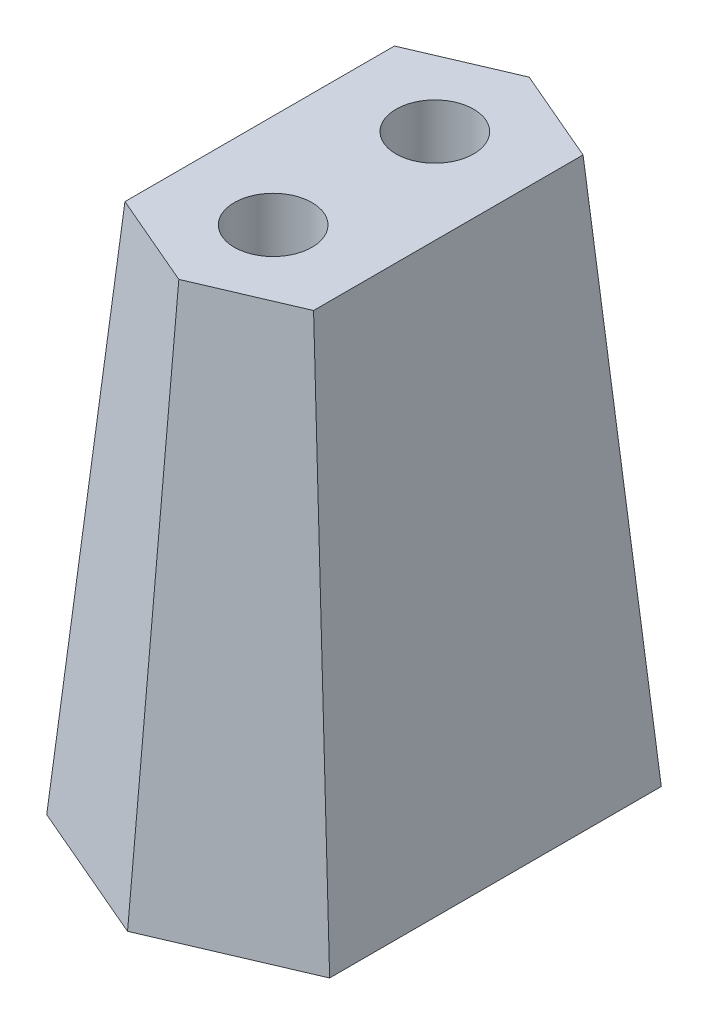
ISO-10303-21;
HEADER;
FILE_DESCRIPTION(('STEP AP214'),'2;1');
FILE_NAME('part.step','',(''),(''),'','','');
FILE_SCHEMA(('AUTOMOTIVE_DESIGN { 1 0 10303 214 1 1 1 1 }'));
ENDSEC;
DATA;
#1=APPLICATION_CONTEXT('core data for automotive mechanical design processes');
#2=APPLICATION_PROTOCOL_DEFINITION('international standard','automotive_design',2000,#1);
#3=PRODUCT_CONTEXT('',#1,'mechanical');
#4=PRODUCT('Part','Part','',(#3));
#5=PRODUCT_RELATED_PRODUCT_CATEGORY('part','',(#4));
#6=PRODUCT_DEFINITION_FORMATION('','',#4);
#7=PRODUCT_DEFINITION_CONTEXT('part definition',#1,'design');
#8=PRODUCT_DEFINITION('design','',#6,#7);
#9=PRODUCT_DEFINITION_SHAPE('','',#8);
#10=(LENGTH_UNIT() NAMED_UNIT(*) SI_UNIT(.MILLI.,.METRE.));
#11=(NAMED_UNIT(*) PLANE_ANGLE_UNIT() SI_UNIT($,.RADIAN.));
#12=(NAMED_UNIT(*) SI_UNIT($,.STERADIAN.) SOLID_ANGLE_UNIT());
#13=UNCERTAINTY_MEASURE_WITH_UNIT(LENGTH_MEASURE(1.E-05),#10,'distance_accuracy_value','');
#14=(GEOMETRIC_REPRESENTATION_CONTEXT(3) GLOBAL_UNCERTAINTY_ASSIGNED_CONTEXT((#13)) GLOBAL_UNIT_ASSIGNED_CONTEXT((#10,
#11,#12)) REPRESENTATION_CONTEXT('',''));
#15=CARTESIAN_POINT('',(0.,0.,0.));
#16=DIRECTION('',(0.,0.,1.));
#17=DIRECTION('',(1.,0.,0.));
#18=AXIS2_PLACEMENT_3D('',#15,#16,#17);
#19=CARTESIAN_POINT('',(0.,0.,0.));
#20=DIRECTION('',(0.,1.,0.));
#21=DIRECTION('',(0.,0.,1.));
#22=AXIS2_PLACEMENT_3D('',#19,#20,#21);
#23=PLANE('',#22);
#24=DIRECTION('',(0.919145030018058,0.,0.393919298579168));
#25=VECTOR('',#24,1.);
#26=CARTESIAN_POINT('',(0.689269459395217,0.,-8.10829540525551));
#27=LINE('',#26,#25);
#28=CARTESIAN_POINT('',(5.24977327051848,0.,-6.15379377191696));
#29=VERTEX_POINT('',#28);
#30=CARTESIAN_POINT('',(0.,0.,-8.40369660213917));
#31=VERTEX_POINT('',#30);
#32=EDGE_CURVE('E206',#29,#31,#27,.F.);
#33=ORIENTED_EDGE('',*,*,#32,.F.);
#34=DIRECTION('',(0.,0.,1.));
#35=VECTOR('',#34,1.);
#36=CARTESIAN_POINT('',(5.24977327051848,0.,5.));
#37=LINE('',#36,#35);
#38=CARTESIAN_POINT('',(5.24977327051848,0.,6.15379377191697));
#39=VERTEX_POINT('',#38);
#40=EDGE_CURVE('E202',#39,#29,#37,.F.);
#41=ORIENTED_EDGE('',*,*,#40,.F.);
#42=DIRECTION('',(-0.919145030018058,0.,0.393919298579168));
#43=VECTOR('',#42,1.);
#44=CARTESIAN_POINT('',(4.18926945939522,0.,6.60829540525551));
#45=LINE('',#44,#43);
#46=CARTESIAN_POINT('',(0.,0.,8.40369660213917));
#47=VERTEX_POINT('',#46);
#48=EDGE_CURVE('E198',#47,#39,#45,.F.);
#49=ORIENTED_EDGE('',*,*,#48,.F.);
#50=DIRECTION('',(-0.919145030018058,0.,-0.393919298579168));
#51=VECTOR('',#50,1.);
#52=CARTESIAN_POINT('',(-0.689269459395218,0.,8.10829540525551));
#53=LINE('',#52,#51);
#54=CARTESIAN_POINT('',(-5.24977327051848,0.,6.15379377191696));
#55=VERTEX_POINT('',#54);
#56=EDGE_CURVE('E195',#55,#47,#53,.F.);
#57=ORIENTED_EDGE('',*,*,#56,.F.);
#58=DIRECTION('',(0.,0.,-1.));
#59=VECTOR('',#58,1.);
#60=CARTESIAN_POINT('',(-5.24977327051848,0.,5.));
#61=LINE('',#60,#59);
#62=CARTESIAN_POINT('',(-5.24977327051849,0.,-6.15379377191696));
#63=VERTEX_POINT('',#62);
#64=EDGE_CURVE('E199',#63,#55,#61,.F.);
#65=ORIENTED_EDGE('',*,*,#64,.F.);
#66=DIRECTION('',(0.919145030018058,0.,-0.393919298579168));
#67=VECTOR('',#66,1.);
#68=CARTESIAN_POINT('',(-4.18926945939522,0.,-6.6082954052555));
#69=LINE('',#68,#67);
#70=EDGE_CURVE('E210',#31,#63,#69,.F.);
#71=ORIENTED_EDGE('',*,*,#70,.F.);
#72=EDGE_LOOP('',(#33,#41,#49,#57,#65,#71));
#73=FACE_BOUND('',#72,.T.);
#74=DIRECTION('',(-0.919145030018058,0.,-0.393919298579168));
#75=VECTOR('',#74,1.);
#76=CARTESIAN_POINT('',(0.347293002806306,0.,-7.31035033988138));
#77=LINE('',#76,#75);
#78=CARTESIAN_POINT('',(4.38163490354232,0.,-5.58134666813737));
#79=VERTEX_POINT('',#78);
#80=CARTESIAN_POINT('',(0.,0.,-7.45919019822694));
#81=VERTEX_POINT('',#80);
#82=EDGE_CURVE('E59',#79,#81,#77,.T.);
#83=ORIENTED_EDGE('',*,*,#82,.T.);
#84=DIRECTION('',(-0.919145030018058,0.,0.393919298579168));
#85=VECTOR('',#84,1.);
#86=CARTESIAN_POINT('',(-3.84729300280631,0.,-5.81035033988138));
#87=LINE('',#86,#85);
#88=CARTESIAN_POINT('',(-4.38163490354233,0.,-5.58134666813737));
#89=VERTEX_POINT('',#88);
#90=EDGE_CURVE('E43',#81,#89,#87,.T.);
#91=ORIENTED_EDGE('',*,*,#90,.T.);
#92=DIRECTION('',(0.,0.,1.));
#93=VECTOR('',#92,1.);
#94=CARTESIAN_POINT('',(-4.38163490354233,0.,5.));
#95=LINE('',#94,#93);
#96=CARTESIAN_POINT('',(-4.38163490354233,0.,5.58134666813737));
#97=VERTEX_POINT('',#96);
#98=EDGE_CURVE('E171',#89,#97,#95,.T.);
#99=ORIENTED_EDGE('',*,*,#98,.T.);
#100=DIRECTION('',(0.919145030018058,0.,0.393919298579168));
#101=VECTOR('',#100,1.);
#102=CARTESIAN_POINT('',(-0.347293002806306,0.,7.31035033988138));
#103=LINE('',#102,#101);
#104=CARTESIAN_POINT('',(0.,0.,7.45919019822694));
#105=VERTEX_POINT('',#104);
#106=EDGE_CURVE('E167',#97,#105,#103,.T.);
#107=ORIENTED_EDGE('',*,*,#106,.T.);
#108=DIRECTION('',(0.919145030018058,0.,-0.393919298579168));
#109=VECTOR('',#108,1.);
#110=CARTESIAN_POINT('',(3.84729300280631,0.,5.81035033988138));
#111=LINE('',#110,#109);
#112=CARTESIAN_POINT('',(4.38163490354233,0.,5.58134666813737));
#113=VERTEX_POINT('',#112);
#114=EDGE_CURVE('E149',#105,#113,#111,.T.);
#115=ORIENTED_EDGE('',*,*,#114,.T.);
#116=DIRECTION('',(0.,0.,-1.));
#117=VECTOR('',#116,1.);
#118=CARTESIAN_POINT('',(4.38163490354233,0.,5.));
#119=LINE('',#118,#117);
#120=EDGE_CURVE('E160',#113,#79,#119,.T.);
#121=ORIENTED_EDGE('',*,*,#120,.T.);
#122=EDGE_LOOP('',(#83,#91,#99,#107,#115,#121));
#123=FACE_BOUND('',#122,.T.);
#124=ADVANCED_FACE('F39',(#73,#123),#23,.F.);
#125=CARTESIAN_POINT('',(0.,20.,-6.5));
#126=DIRECTION('',(0.392420316720586,0.0871557427476584,-0.915647405681368));
#127=DIRECTION('',(-0.919145030018058,0.,-0.393919298579168));
#128=AXIS2_PLACEMENT_3D('',#125,#126,#127);
#129=PLANE('',#128);
#130=ORIENTED_EDGE('',*,*,#32,.T.);
#131=DIRECTION('',(0.,-0.995500475857492,-0.0947565436658919));
#132=VECTOR('',#131,1.);
#133=CARTESIAN_POINT('',(0.,20.141495276465,-6.48653179614874));
#134=LINE('',#133,#132);
#135=CARTESIAN_POINT('',(0.,20.,-6.5));
#136=VERTEX_POINT('',#135);
#137=EDGE_CURVE('E11',#136,#31,#134,.T.);
#138=ORIENTED_EDGE('',*,*,#137,.F.);
#139=DIRECTION('',(-0.919145030018058,0.,-0.393919298579168));
#140=VECTOR('',#139,1.);
#141=CARTESIAN_POINT('',(0.,20.,-6.5));
#142=LINE('',#141,#140);
#143=CARTESIAN_POINT('',(3.5,20.,-5.));
#144=VERTEX_POINT('',#143);
#145=EDGE_CURVE('E205',#144,#136,#142,.T.);
#146=ORIENTED_EDGE('',*,*,#145,.F.);
#147=DIRECTION('',(0.087012168456116,-0.994553636430084,-0.05737548957752));
#148=VECTOR('',#147,1.);
#149=CARTESIAN_POINT('',(3.48098963753853,20.217289437229,-4.98746464003109));
#150=LINE('',#149,#148);
#151=EDGE_CURVE('E225',#144,#29,#150,.T.);
#152=ORIENTED_EDGE('',*,*,#151,.T.);
#153=EDGE_LOOP('',(#130,#138,#146,#152));
#154=FACE_BOUND('',#153,.T.);
#155=ADVANCED_FACE('F292',(#154),#129,.T.);
#156=CARTESIAN_POINT('',(-3.5,20.,-5.));
#157=DIRECTION('',(-0.392420316720587,0.0871557427476584,-0.915647405681367));
#158=DIRECTION('',(-0.919145030018058,0.,0.393919298579168));
#159=AXIS2_PLACEMENT_3D('',#156,#157,#158);
#160=PLANE('',#159);
#161=ORIENTED_EDGE('',*,*,#70,.T.);
#162=DIRECTION('',(-0.087012168456116,-0.994553636430084,-0.05737548957752));
#163=VECTOR('',#162,1.);
#164=CARTESIAN_POINT('',(-3.45007634235629,20.5706300180128,-4.96708053195739));
#165=LINE('',#164,#163);
#166=CARTESIAN_POINT('',(-3.5,20.,-5.));
#167=VERTEX_POINT('',#166);
#168=EDGE_CURVE('E50',#167,#63,#165,.T.);
#169=ORIENTED_EDGE('',*,*,#168,.F.);
#170=DIRECTION('',(-0.919145030018058,0.,0.393919298579168));
#171=VECTOR('',#170,1.);
#172=CARTESIAN_POINT('',(-3.5,20.,-5.));
#173=LINE('',#172,#171);
#174=EDGE_CURVE('E247',#136,#167,#173,.T.);
#175=ORIENTED_EDGE('',*,*,#174,.F.);
#176=ORIENTED_EDGE('',*,*,#137,.T.);
#177=EDGE_LOOP('',(#161,#169,#175,#176));
#178=FACE_BOUND('',#177,.T.);
#179=ADVANCED_FACE('F298',(#178),#160,.T.);
#180=CARTESIAN_POINT('',(-3.5,20.,5.));
#181=DIRECTION('',(-0.996194698091746,0.0871557427476584,0.));
#182=DIRECTION('',(-0.0871557427476584,-0.996194698091746,0.));
#183=AXIS2_PLACEMENT_3D('',#180,#181,#182);
#184=PLANE('',#183);
#185=ORIENTED_EDGE('',*,*,#64,.T.);
#186=DIRECTION('',(-0.087012168456116,-0.994553636430084,0.05737548957752));
#187=VECTOR('',#186,1.);
#188=CARTESIAN_POINT('',(-3.48098963753853,20.217289437229,4.98746464003109));
#189=LINE('',#188,#187);
#190=CARTESIAN_POINT('',(-3.5,20.,5.));
#191=VERTEX_POINT('',#190);
#192=EDGE_CURVE('E220',#191,#55,#189,.T.);
#193=ORIENTED_EDGE('',*,*,#192,.F.);
#194=DIRECTION('',(0.,0.,1.));
#195=VECTOR('',#194,1.);
#196=CARTESIAN_POINT('',(-3.5,20.,5.));
#197=LINE('',#196,#195);
#198=EDGE_CURVE('E244',#167,#191,#197,.T.);
#199=ORIENTED_EDGE('',*,*,#198,.F.);
#200=ORIENTED_EDGE('',*,*,#168,.T.);
#201=EDGE_LOOP('',(#185,#193,#199,#200));
#202=FACE_BOUND('',#201,.T.);
#203=ADVANCED_FACE('F306',(#202),#184,.T.);
#204=CARTESIAN_POINT('',(0.,20.,6.5));
#205=DIRECTION('',(-0.392420316720587,0.0871557427476584,0.915647405681367));
#206=DIRECTION('',(0.919145030018058,0.,0.393919298579168));
#207=AXIS2_PLACEMENT_3D('',#204,#205,#206);
#208=PLANE('',#207);
#209=ORIENTED_EDGE('',*,*,#56,.T.);
#210=DIRECTION('',(0.,-0.995500475857492,0.0947565436658919));
#211=VECTOR('',#210,1.);
#212=CARTESIAN_POINT('',(0.,20.141495276465,6.48653179614874));
#213=LINE('',#212,#211);
#214=CARTESIAN_POINT('',(0.,20.,6.5));
#215=VERTEX_POINT('',#214);
#216=EDGE_CURVE('E216',#215,#47,#213,.T.);
#217=ORIENTED_EDGE('',*,*,#216,.F.);
#218=DIRECTION('',(0.919145030018058,0.,0.393919298579168));
#219=VECTOR('',#218,1.);
#220=CARTESIAN_POINT('',(0.,20.,6.5));
#221=LINE('',#220,#219);
#222=EDGE_CURVE('E241',#191,#215,#221,.T.);
#223=ORIENTED_EDGE('',*,*,#222,.F.);
#224=ORIENTED_EDGE('',*,*,#192,.T.);
#225=EDGE_LOOP('',(#209,#217,#223,#224));
#226=FACE_BOUND('',#225,.T.);
#227=ADVANCED_FACE('F309',(#226),#208,.T.);
#228=CARTESIAN_POINT('',(3.5,20.,5.));
#229=DIRECTION('',(0.392420316720586,0.0871557427476584,0.915647405681367));
#230=DIRECTION('',(0.919145030018058,0.,-0.393919298579168));
#231=AXIS2_PLACEMENT_3D('',#228,#229,#230);
#232=PLANE('',#231);
#233=ORIENTED_EDGE('',*,*,#48,.T.);
#234=DIRECTION('',(0.087012168456116,-0.994553636430084,0.05737548957752));
#235=VECTOR('',#234,1.);
#236=CARTESIAN_POINT('',(3.5,20.,5.));
#237=LINE('',#236,#235);
#238=CARTESIAN_POINT('',(3.5,20.,5.));
#239=VERTEX_POINT('',#238);
#240=EDGE_CURVE('E221',#239,#39,#237,.T.);
#241=ORIENTED_EDGE('',*,*,#240,.F.);
#242=DIRECTION('',(0.919145030018058,0.,-0.393919298579168));
#243=VECTOR('',#242,1.);
#244=CARTESIAN_POINT('',(3.5,20.,5.));
#245=LINE('',#244,#243);
#246=EDGE_CURVE('E238',#215,#239,#245,.T.);
#247=ORIENTED_EDGE('',*,*,#246,.F.);
#248=ORIENTED_EDGE('',*,*,#216,.T.);
#249=EDGE_LOOP('',(#233,#241,#247,#248));
#250=FACE_BOUND('',#249,.T.);
#251=ADVANCED_FACE('F317',(#250),#232,.T.);
#252=CARTESIAN_POINT('',(3.5,20.,5.));
#253=DIRECTION('',(0.996194698091746,0.0871557427476584,0.));
#254=DIRECTION('',(-0.0871557427476584,0.996194698091746,0.));
#255=AXIS2_PLACEMENT_3D('',#252,#253,#254);
#256=PLANE('',#255);
#257=ORIENTED_EDGE('',*,*,#40,.T.);
#258=ORIENTED_EDGE('',*,*,#151,.F.);
#259=DIRECTION('',(0.,0.,-1.));
#260=VECTOR('',#259,1.);
#261=CARTESIAN_POINT('',(3.5,20.,5.));
#262=LINE('',#261,#260);
#263=EDGE_CURVE('E228',#239,#144,#262,.T.);
#264=ORIENTED_EDGE('',*,*,#263,.F.);
#265=ORIENTED_EDGE('',*,*,#240,.T.);
#266=EDGE_LOOP('',(#257,#258,#264,#265));
#267=FACE_BOUND('',#266,.T.);
#268=ADVANCED_FACE('F314',(#267),#256,.T.);
#269=CARTESIAN_POINT('',(0.,20.,0.));
#270=DIRECTION('',(0.,1.,0.));
#271=DIRECTION('',(0.,0.,1.));
#272=AXIS2_PLACEMENT_3D('',#269,#270,#271);
#273=PLANE('',#272);
#274=CARTESIAN_POINT('',(0.,20.,-3.));
#275=DIRECTION('',(0.,1.,0.));
#276=DIRECTION('',(0.,0.,1.));
#277=AXIS2_PLACEMENT_3D('',#274,#275,#276);
#278=CIRCLE('',#277,1.44);
#279=CARTESIAN_POINT('',(0.,20.,-1.56));
#280=VERTEX_POINT('',#279);
#281=EDGE_CURVE('E211',#280,#280,#278,.T.);
#282=ORIENTED_EDGE('',*,*,#281,.F.);
#283=EDGE_LOOP('',(#282));
#284=FACE_BOUND('',#283,.T.);
#285=CARTESIAN_POINT('',(0.,20.,3.));
#286=DIRECTION('',(0.,1.,0.));
#287=DIRECTION('',(0.,0.,1.));
#288=AXIS2_PLACEMENT_3D('',#285,#286,#287);
#289=CIRCLE('',#288,1.44);
#290=CARTESIAN_POINT('',(0.,20.,4.44));
#291=VERTEX_POINT('',#290);
#292=EDGE_CURVE('E253',#291,#291,#289,.T.);
#293=ORIENTED_EDGE('',*,*,#292,.F.);
#294=EDGE_LOOP('',(#293));
#295=FACE_BOUND('',#294,.T.);
#296=ORIENTED_EDGE('',*,*,#145,.T.);
#297=ORIENTED_EDGE('',*,*,#174,.T.);
#298=ORIENTED_EDGE('',*,*,#198,.T.);
#299=ORIENTED_EDGE('',*,*,#222,.T.);
#300=ORIENTED_EDGE('',*,*,#246,.T.);
#301=ORIENTED_EDGE('',*,*,#263,.T.);
#302=EDGE_LOOP('',(#296,#297,#298,#299,#300,#301));
#303=FACE_BOUND('',#302,.T.);
#304=ADVANCED_FACE('F304',(#284,#295,#303),#273,.T.);
#305=CARTESIAN_POINT('',(0.,0.,3.));
#306=DIRECTION('',(0.,1.,0.));
#307=DIRECTION('',(0.,0.,1.));
#308=AXIS2_PLACEMENT_3D('',#305,#306,#307);
#309=CYLINDRICAL_SURFACE('',#308,1.44);
#310=CARTESIAN_POINT('',(0.,5.,3.));
#311=DIRECTION('',(0.,1.,0.));
#312=DIRECTION('',(0.,0.,1.));
#313=AXIS2_PLACEMENT_3D('',#310,#311,#312);
#314=CIRCLE('',#313,1.44);
#315=CARTESIAN_POINT('',(0.,5.,4.44));
#316=VERTEX_POINT('',#315);
#317=EDGE_CURVE('E194',#316,#316,#314,.F.);
#318=ORIENTED_EDGE('',*,*,#317,.T.);
#319=EDGE_LOOP('',(#318));
#320=FACE_BOUND('',#319,.T.);
#321=ORIENTED_EDGE('',*,*,#292,.T.);
#322=EDGE_LOOP('',(#321));
#323=FACE_BOUND('',#322,.T.);
#324=ADVANCED_FACE('F343',(#320,#323),#309,.F.);
#325=CARTESIAN_POINT('',(0.,0.,-3.));
#326=DIRECTION('',(0.,1.,0.));
#327=DIRECTION('',(0.,0.,1.));
#328=AXIS2_PLACEMENT_3D('',#325,#326,#327);
#329=CYLINDRICAL_SURFACE('',#328,1.44);
#330=CARTESIAN_POINT('',(0.,5.,-3.));
#331=DIRECTION('',(0.,1.,0.));
#332=DIRECTION('',(0.,0.,1.));
#333=AXIS2_PLACEMENT_3D('',#330,#331,#332);
#334=CIRCLE('',#333,1.44);
#335=CARTESIAN_POINT('',(0.,5.,-1.56));
#336=VERTEX_POINT('',#335);
#337=EDGE_CURVE('E181',#336,#336,#334,.F.);
#338=ORIENTED_EDGE('',*,*,#337,.T.);
#339=EDGE_LOOP('',(#338));
#340=FACE_BOUND('',#339,.T.);
#341=ORIENTED_EDGE('',*,*,#281,.T.);
#342=EDGE_LOOP('',(#341));
#343=FACE_BOUND('',#342,.T.);
#344=ADVANCED_FACE('F348',(#340,#343),#329,.F.);
#345=CARTESIAN_POINT('',(0.,5.,0.));
#346=DIRECTION('',(0.,1.,0.));
#347=DIRECTION('',(0.,0.,1.));
#348=AXIS2_PLACEMENT_3D('',#345,#346,#347);
#349=PLANE('',#348);
#350=ORIENTED_EDGE('',*,*,#337,.F.);
#351=EDGE_LOOP('',(#350));
#352=FACE_BOUND('',#351,.T.);
#353=DIRECTION('',(-0.919145030018058,0.,-0.393919298579168));
#354=VECTOR('',#353,1.);
#355=CARTESIAN_POINT('',(0.,5.,-6.5));
#356=LINE('',#355,#354);
#357=CARTESIAN_POINT('',(3.5,5.,-5.));
#358=VERTEX_POINT('',#357);
#359=CARTESIAN_POINT('',(0.,5.,-6.5));
#360=VERTEX_POINT('',#359);
#361=EDGE_CURVE('E164',#358,#360,#356,.T.);
#362=ORIENTED_EDGE('',*,*,#361,.F.);
#363=DIRECTION('',(0.,0.,-1.));
#364=VECTOR('',#363,1.);
#365=CARTESIAN_POINT('',(3.5,5.,5.));
#366=LINE('',#365,#364);
#367=CARTESIAN_POINT('',(3.5,5.,5.));
#368=VERTEX_POINT('',#367);
#369=EDGE_CURVE('E183',#368,#358,#366,.T.);
#370=ORIENTED_EDGE('',*,*,#369,.F.);
#371=DIRECTION('',(0.919145030018058,0.,-0.393919298579168));
#372=VECTOR('',#371,1.);
#373=CARTESIAN_POINT('',(3.5,5.,5.));
#374=LINE('',#373,#372);
#375=CARTESIAN_POINT('',(0.,5.,6.5));
#376=VERTEX_POINT('',#375);
#377=EDGE_CURVE('E152',#376,#368,#374,.T.);
#378=ORIENTED_EDGE('',*,*,#377,.F.);
#379=DIRECTION('',(0.919145030018058,0.,0.393919298579168));
#380=VECTOR('',#379,1.);
#381=CARTESIAN_POINT('',(0.,5.,6.5));
#382=LINE('',#381,#380);
#383=CARTESIAN_POINT('',(-3.5,5.,5.));
#384=VERTEX_POINT('',#383);
#385=EDGE_CURVE('E267',#384,#376,#382,.T.);
#386=ORIENTED_EDGE('',*,*,#385,.F.);
#387=DIRECTION('',(0.,0.,1.));
#388=VECTOR('',#387,1.);
#389=CARTESIAN_POINT('',(-3.5,5.,5.));
#390=LINE('',#389,#388);
#391=CARTESIAN_POINT('',(-3.5,5.,-5.));
#392=VERTEX_POINT('',#391);
#393=EDGE_CURVE('E270',#392,#384,#390,.T.);
#394=ORIENTED_EDGE('',*,*,#393,.F.);
#395=DIRECTION('',(-0.919145030018058,0.,0.393919298579168));
#396=VECTOR('',#395,1.);
#397=CARTESIAN_POINT('',(-3.5,5.,-5.));
#398=LINE('',#397,#396);
#399=EDGE_CURVE('E138',#360,#392,#398,.T.);
#400=ORIENTED_EDGE('',*,*,#399,.F.);
#401=EDGE_LOOP('',(#362,#370,#378,#386,#394,#400));
#402=FACE_BOUND('',#401,.T.);
#403=ORIENTED_EDGE('',*,*,#317,.F.);
#404=EDGE_LOOP('',(#403));
#405=FACE_BOUND('',#404,.T.);
#406=ADVANCED_FACE('F279',(#352,#402,#405),#349,.F.);
#407=CARTESIAN_POINT('',(0.,5.,-6.5));
#408=DIRECTION('',(-0.387934779301895,-0.173648177666931,0.905181151704422));
#409=DIRECTION('',(0.919145030018058,0.,0.393919298579168));
#410=AXIS2_PLACEMENT_3D('',#407,#408,#409);
#411=PLANE('',#410);
#412=ORIENTED_EDGE('',*,*,#82,.F.);
#413=DIRECTION('',(0.172520906320835,-0.978414679521318,-0.113759622799282));
#414=VECTOR('',#413,1.);
#415=CARTESIAN_POINT('',(3.4252667489299,5.42383332811476,-4.95072118137098));
#416=LINE('',#415,#414);
#417=EDGE_CURVE('E157',#358,#79,#416,.T.);
#418=ORIENTED_EDGE('',*,*,#417,.F.);
#419=ORIENTED_EDGE('',*,*,#361,.T.);
#420=DIRECTION('',(0.,-0.982091883293207,-0.188402581642616));
#421=VECTOR('',#420,1.);
#422=CARTESIAN_POINT('',(0.,5.27754296933405,-6.44675670084559));
#423=LINE('',#422,#421);
#424=EDGE_CURVE('E178',#360,#81,#423,.T.);
#425=ORIENTED_EDGE('',*,*,#424,.T.);
#426=EDGE_LOOP('',(#412,#418,#419,#425));
#427=FACE_BOUND('',#426,.T.);
#428=ADVANCED_FACE('F276',(#427),#411,.T.);
#429=CARTESIAN_POINT('',(-3.5,5.,-5.));
#430=DIRECTION('',(0.387934779301896,-0.173648177666931,0.905181151704422));
#431=DIRECTION('',(0.919145030018058,0.,-0.393919298579168));
#432=AXIS2_PLACEMENT_3D('',#429,#430,#431);
#433=PLANE('',#432);
#434=ORIENTED_EDGE('',*,*,#90,.F.);
#435=ORIENTED_EDGE('',*,*,#424,.F.);
#436=ORIENTED_EDGE('',*,*,#399,.T.);
#437=DIRECTION('',(-0.172520906320835,-0.978414679521318,-0.113759622799282));
#438=VECTOR('',#437,1.);
#439=CARTESIAN_POINT('',(-3.30374086771952,6.11304084883626,-4.87058748220565));
#440=LINE('',#439,#438);
#441=EDGE_CURVE('E76',#392,#89,#440,.T.);
#442=ORIENTED_EDGE('',*,*,#441,.T.);
#443=EDGE_LOOP('',(#434,#435,#436,#442));
#444=FACE_BOUND('',#443,.T.);
#445=ADVANCED_FACE('F41',(#444),#433,.T.);
#446=CARTESIAN_POINT('',(-3.5,5.,5.));
#447=DIRECTION('',(0.984807753012208,-0.173648177666931,0.));
#448=DIRECTION('',(0.173648177666931,0.984807753012208,0.));
#449=AXIS2_PLACEMENT_3D('',#446,#447,#448);
#450=PLANE('',#449);
#451=ORIENTED_EDGE('',*,*,#98,.F.);
#452=ORIENTED_EDGE('',*,*,#441,.F.);
#453=ORIENTED_EDGE('',*,*,#393,.T.);
#454=DIRECTION('',(-0.172520906320835,-0.978414679521318,0.113759622799282));
#455=VECTOR('',#454,1.);
#456=CARTESIAN_POINT('',(-3.4252667489299,5.42383332811476,4.95072118137098));
#457=LINE('',#456,#455);
#458=EDGE_CURVE('E84',#384,#97,#457,.T.);
#459=ORIENTED_EDGE('',*,*,#458,.T.);
#460=EDGE_LOOP('',(#451,#452,#453,#459));
#461=FACE_BOUND('',#460,.T.);
#462=ADVANCED_FACE('F277',(#461),#450,.T.);
#463=CARTESIAN_POINT('',(0.,5.,6.5));
#464=DIRECTION('',(0.387934779301896,-0.173648177666931,-0.905181151704422));
#465=DIRECTION('',(-0.919145030018058,0.,-0.393919298579168));
#466=AXIS2_PLACEMENT_3D('',#463,#464,#465);
#467=PLANE('',#466);
#468=ORIENTED_EDGE('',*,*,#106,.F.);
#469=ORIENTED_EDGE('',*,*,#458,.F.);
#470=ORIENTED_EDGE('',*,*,#385,.T.);
#471=DIRECTION('',(0.,-0.982091883293207,0.188402581642616));
#472=VECTOR('',#471,1.);
#473=CARTESIAN_POINT('',(0.,5.27754296933405,6.4467567008456));
#474=LINE('',#473,#472);
#475=EDGE_CURVE('E156',#376,#105,#474,.T.);
#476=ORIENTED_EDGE('',*,*,#475,.T.);
#477=EDGE_LOOP('',(#468,#469,#470,#476));
#478=FACE_BOUND('',#477,.T.);
#479=ADVANCED_FACE('F282',(#478),#467,.T.);
#480=CARTESIAN_POINT('',(3.5,5.,5.));
#481=DIRECTION('',(-0.387934779301895,-0.173648177666931,-0.905181151704422));
#482=DIRECTION('',(-0.919145030018058,0.,0.393919298579168));
#483=AXIS2_PLACEMENT_3D('',#480,#481,#482);
#484=PLANE('',#483);
#485=ORIENTED_EDGE('',*,*,#114,.F.);
#486=ORIENTED_EDGE('',*,*,#475,.F.);
#487=ORIENTED_EDGE('',*,*,#377,.T.);
#488=DIRECTION('',(0.172520906320835,-0.978414679521318,0.113759622799282));
#489=VECTOR('',#488,1.);
#490=CARTESIAN_POINT('',(3.5,5.,5.));
#491=LINE('',#490,#489);
#492=EDGE_CURVE('E144',#368,#113,#491,.T.);
#493=ORIENTED_EDGE('',*,*,#492,.T.);
#494=EDGE_LOOP('',(#485,#486,#487,#493));
#495=FACE_BOUND('',#494,.T.);
#496=ADVANCED_FACE('F146',(#495),#484,.T.);
#497=CARTESIAN_POINT('',(3.5,5.,5.));
#498=DIRECTION('',(-0.984807753012208,-0.173648177666931,0.));
#499=DIRECTION('',(0.173648177666931,-0.984807753012208,0.));
#500=AXIS2_PLACEMENT_3D('',#497,#498,#499);
#501=PLANE('',#500);
#502=ORIENTED_EDGE('',*,*,#120,.F.);
#503=ORIENTED_EDGE('',*,*,#492,.F.);
#504=ORIENTED_EDGE('',*,*,#369,.T.);
#505=ORIENTED_EDGE('',*,*,#417,.T.);
#506=EDGE_LOOP('',(#502,#503,#504,#505));
#507=FACE_BOUND('',#506,.T.);
#508=ADVANCED_FACE('F161',(#507),#501,.T.);
#509=CLOSED_SHELL('',(#124,#155,#179,#203,#227,#251,#268,#304,#324,#344,#406,#428,#445,#462,
#479,#496,#508));
#510=MANIFOLD_SOLID_BREP('B2',#509);
#511=ADVANCED_BREP_SHAPE_REPRESENTATION('',(#18,#510),#14);
#512=SHAPE_DEFINITION_REPRESENTATION(#9,#511);
ENDSEC;
END-ISO-10303-21;
